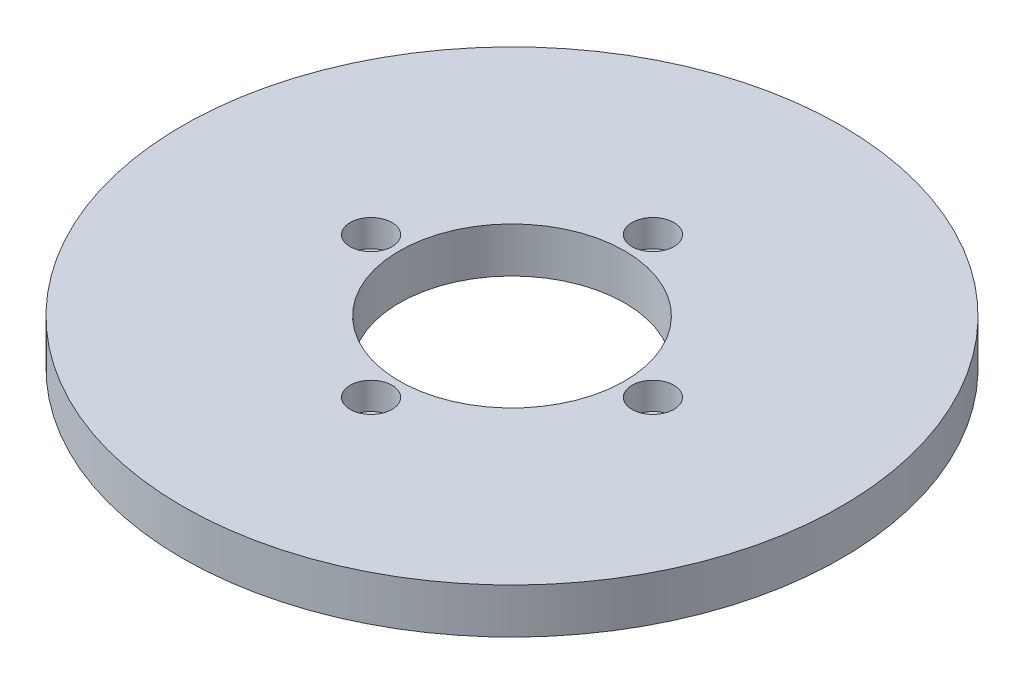
ISO-10303-21;
HEADER;
FILE_DESCRIPTION(('STEP AP214'),'2;1');
FILE_NAME('part.step','',(''),(''),'','','');
FILE_SCHEMA(('AUTOMOTIVE_DESIGN { 1 0 10303 214 1 1 1 1 }'));
ENDSEC;
DATA;
#1=APPLICATION_CONTEXT('core data for automotive mechanical design processes');
#2=APPLICATION_PROTOCOL_DEFINITION('international standard','automotive_design',2000,#1);
#3=PRODUCT_CONTEXT('',#1,'mechanical');
#4=PRODUCT('Part','Part','',(#3));
#5=PRODUCT_RELATED_PRODUCT_CATEGORY('part','',(#4));
#6=PRODUCT_DEFINITION_FORMATION('','',#4);
#7=PRODUCT_DEFINITION_CONTEXT('part definition',#1,'design');
#8=PRODUCT_DEFINITION('design','',#6,#7);
#9=PRODUCT_DEFINITION_SHAPE('','',#8);
#10=(LENGTH_UNIT() NAMED_UNIT(*) SI_UNIT(.MILLI.,.METRE.));
#11=(NAMED_UNIT(*) PLANE_ANGLE_UNIT() SI_UNIT($,.RADIAN.));
#12=(NAMED_UNIT(*) SI_UNIT($,.STERADIAN.) SOLID_ANGLE_UNIT());
#13=UNCERTAINTY_MEASURE_WITH_UNIT(LENGTH_MEASURE(1.E-05),#10,'distance_accuracy_value','');
#14=(GEOMETRIC_REPRESENTATION_CONTEXT(3) GLOBAL_UNCERTAINTY_ASSIGNED_CONTEXT((#13)) GLOBAL_UNIT_ASSIGNED_CONTEXT((#10,
#11,#12)) REPRESENTATION_CONTEXT('',''));
#15=CARTESIAN_POINT('',(0.,0.,0.));
#16=DIRECTION('',(0.,0.,1.));
#17=DIRECTION('',(1.,0.,0.));
#18=AXIS2_PLACEMENT_3D('',#15,#16,#17);
#19=CARTESIAN_POINT('',(0.,13.,0.));
#20=DIRECTION('',(0.,-1.,0.));
#21=DIRECTION('',(0.,0.,-1.));
#22=AXIS2_PLACEMENT_3D('',#19,#20,#21);
#23=CYLINDRICAL_SURFACE('',#22,95.);
#24=CARTESIAN_POINT('',(0.,13.,0.));
#25=DIRECTION('',(0.,1.,0.));
#26=DIRECTION('',(0.,0.,1.));
#27=AXIS2_PLACEMENT_3D('',#24,#25,#26);
#28=CIRCLE('',#27,95.);
#29=CARTESIAN_POINT('',(0.,13.,-95.));
#30=VERTEX_POINT('',#29);
#31=EDGE_CURVE('E10',#30,#30,#28,.T.);
#32=CARTESIAN_POINT('',(0.,0.,0.));
#33=DIRECTION('',(0.,1.,0.));
#34=DIRECTION('',(0.,0.,1.));
#35=AXIS2_PLACEMENT_3D('',#32,#33,#34);
#36=CIRCLE('',#35,95.);
#37=CARTESIAN_POINT('',(0.,0.,-95.));
#38=VERTEX_POINT('',#37);
#39=EDGE_CURVE('E37',#38,#38,#36,.T.);
#40=CARTESIAN_POINT('',(0.,13.,-95.));
#41=CARTESIAN_POINT('',(0.,12.8645833333333,-95.));
#42=CARTESIAN_POINT('',(0.,12.7291666666667,-95.));
#43=CARTESIAN_POINT('',(0.,12.4583333333333,-95.));
#44=CARTESIAN_POINT('',(0.,12.3229166666667,-95.));
#45=CARTESIAN_POINT('',(0.,12.0520833333333,-95.));
#46=CARTESIAN_POINT('',(0.,11.9166666666667,-95.));
#47=CARTESIAN_POINT('',(0.,11.6458333333333,-95.));
#48=CARTESIAN_POINT('',(0.,11.5104166666667,-95.));
#49=CARTESIAN_POINT('',(0.,11.2395833333333,-95.));
#50=CARTESIAN_POINT('',(0.,11.1041666666667,-95.));
#51=CARTESIAN_POINT('',(0.,10.8333333333333,-95.));
#52=CARTESIAN_POINT('',(0.,10.6979166666667,-95.));
#53=CARTESIAN_POINT('',(0.,10.4270833333333,-95.));
#54=CARTESIAN_POINT('',(0.,10.2916666666667,-95.));
#55=CARTESIAN_POINT('',(0.,10.0208333333333,-95.));
#56=CARTESIAN_POINT('',(0.,9.88541666666667,-95.));
#57=CARTESIAN_POINT('',(0.,9.61458333333333,-95.));
#58=CARTESIAN_POINT('',(0.,9.47916666666667,-95.));
#59=CARTESIAN_POINT('',(0.,9.20833333333333,-95.));
#60=CARTESIAN_POINT('',(0.,9.07291666666667,-95.));
#61=CARTESIAN_POINT('',(0.,8.80208333333333,-95.));
#62=CARTESIAN_POINT('',(0.,8.66666666666667,-95.));
#63=CARTESIAN_POINT('',(0.,8.39583333333333,-95.));
#64=CARTESIAN_POINT('',(0.,8.26041666666667,-95.));
#65=CARTESIAN_POINT('',(0.,7.98958333333333,-95.));
#66=CARTESIAN_POINT('',(0.,7.85416666666667,-95.));
#67=CARTESIAN_POINT('',(0.,7.58333333333333,-95.));
#68=CARTESIAN_POINT('',(0.,7.44791666666667,-95.));
#69=CARTESIAN_POINT('',(0.,7.17708333333333,-95.));
#70=CARTESIAN_POINT('',(0.,7.04166666666667,-95.));
#71=CARTESIAN_POINT('',(0.,6.77083333333333,-95.));
#72=CARTESIAN_POINT('',(0.,6.63541666666667,-95.));
#73=CARTESIAN_POINT('',(0.,6.36458333333333,-95.));
#74=CARTESIAN_POINT('',(0.,6.22916666666667,-95.));
#75=CARTESIAN_POINT('',(0.,5.95833333333333,-95.));
#76=CARTESIAN_POINT('',(0.,5.82291666666667,-95.));
#77=CARTESIAN_POINT('',(0.,5.55208333333333,-95.));
#78=CARTESIAN_POINT('',(0.,5.41666666666667,-95.));
#79=CARTESIAN_POINT('',(0.,5.14583333333333,-95.));
#80=CARTESIAN_POINT('',(0.,5.01041666666667,-95.));
#81=CARTESIAN_POINT('',(0.,4.73958333333333,-95.));
#82=CARTESIAN_POINT('',(0.,4.60416666666667,-95.));
#83=CARTESIAN_POINT('',(0.,4.33333333333333,-95.));
#84=CARTESIAN_POINT('',(0.,4.19791666666667,-95.));
#85=CARTESIAN_POINT('',(0.,3.92708333333333,-95.));
#86=CARTESIAN_POINT('',(0.,3.79166666666667,-95.));
#87=CARTESIAN_POINT('',(0.,3.52083333333333,-95.));
#88=CARTESIAN_POINT('',(0.,3.38541666666667,-95.));
#89=CARTESIAN_POINT('',(0.,3.11458333333333,-95.));
#90=CARTESIAN_POINT('',(0.,2.97916666666667,-95.));
#91=CARTESIAN_POINT('',(0.,2.70833333333333,-95.));
#92=CARTESIAN_POINT('',(0.,2.57291666666667,-95.));
#93=CARTESIAN_POINT('',(0.,2.30208333333333,-95.));
#94=CARTESIAN_POINT('',(0.,2.16666666666667,-95.));
#95=CARTESIAN_POINT('',(0.,1.89583333333333,-95.));
#96=CARTESIAN_POINT('',(0.,1.76041666666667,-95.));
#97=CARTESIAN_POINT('',(0.,1.48958333333333,-95.));
#98=CARTESIAN_POINT('',(0.,1.35416666666667,-95.));
#99=CARTESIAN_POINT('',(0.,1.08333333333333,-95.));
#100=CARTESIAN_POINT('',(0.,0.947916666666667,-95.));
#101=CARTESIAN_POINT('',(0.,0.677083333333334,-95.));
#102=CARTESIAN_POINT('',(0.,0.541666666666667,-95.));
#103=CARTESIAN_POINT('',(0.,0.270833333333334,-95.));
#104=CARTESIAN_POINT('',(0.,0.135416666666667,-95.));
#105=CARTESIAN_POINT('',(0.,0.,-95.));
#106=B_SPLINE_CURVE_WITH_KNOTS('',3,(#40,#41,#42,#43,#44,#45,#46,#47,#48,#49,#50,#51,#52,#53,
#54,#55,#56,#57,#58,#59,#60,#61,#62,#63,#64,#65,#66,#67,#68,#69,#70,#71,#72,#73,#74,#75,#76,#77,
#78,#79,#80,#81,#82,#83,#84,#85,#86,#87,#88,#89,#90,#91,#92,#93,#94,#95,#96,#97,#98,#99,#100,
#101,#102,#103,#104,#105),.UNSPECIFIED.,.F.,.F.,(4,2,2,2,2,2,2,2,2,2,2,2,2,2,2,2,2,2,2,2,2,2,2,
2,2,2,2,2,2,2,2,2,4),(0.,0.406249999999999,0.812499999999999,1.21875,1.625,2.03125,2.4375,
2.84375,3.25,3.65625,4.0625,4.46875,4.875,5.28125,5.6875,6.09375,6.5,6.90625,7.3125,7.71875,
8.125,8.53125,8.9375,9.34375,9.75,10.15625,10.5625,10.96875,11.375,11.78125,12.1875,12.59375,
13.),.UNSPECIFIED.);
#107=EDGE_CURVE('BSEAM40',#30,#38,#106,.T.);
#108=ORIENTED_EDGE('',*,*,#31,.F.);
#109=ORIENTED_EDGE('',*,*,#39,.T.);
#110=ORIENTED_EDGE('',*,*,#107,.T.);
#111=ORIENTED_EDGE('',*,*,#107,.F.);
#112=EDGE_LOOP('',(#108,#110,#109,#111));
#113=FACE_BOUND('',#112,.T.);
#114=ADVANCED_FACE('F40',(#113),#23,.T.);
#115=CARTESIAN_POINT('',(0.,13.,0.));
#116=DIRECTION('',(0.,1.,0.));
#117=DIRECTION('',(0.,0.,1.));
#118=AXIS2_PLACEMENT_3D('',#115,#116,#117);
#119=PLANE('',#118);
#120=CARTESIAN_POINT('',(1.4185215696723E-13,13.,40.6280725000899));
#121=DIRECTION('',(0.,1.,0.));
#122=DIRECTION('',(1.,0.,0.));
#123=AXIS2_PLACEMENT_3D('',#120,#121,#122);
#124=CIRCLE('',#123,6.03825694009984);
#125=CARTESIAN_POINT('',(6.03825694009999,13.,40.6280725000899));
#126=VERTEX_POINT('',#125);
#127=EDGE_CURVE('E71',#126,#126,#124,.T.);
#128=ORIENTED_EDGE('',*,*,#127,.F.);
#129=EDGE_LOOP('',(#128));
#130=FACE_BOUND('',#129,.T.);
#131=CARTESIAN_POINT('',(40.6280725000899,13.,0.));
#132=DIRECTION('',(0.,1.,0.));
#133=DIRECTION('',(0.,0.,-1.));
#134=AXIS2_PLACEMENT_3D('',#131,#132,#133);
#135=CIRCLE('',#134,6.03825694009984);
#136=CARTESIAN_POINT('',(40.6280725000899,13.,-6.03825694009984));
#137=VERTEX_POINT('',#136);
#138=EDGE_CURVE('E70',#137,#137,#135,.T.);
#139=ORIENTED_EDGE('',*,*,#138,.F.);
#140=EDGE_LOOP('',(#139));
#141=FACE_BOUND('',#140,.T.);
#142=CARTESIAN_POINT('',(-4.25556470901689E-13,13.,-40.6280725000899));
#143=DIRECTION('',(0.,1.,0.));
#144=DIRECTION('',(-1.,0.,0.));
#145=AXIS2_PLACEMENT_3D('',#142,#143,#144);
#146=CIRCLE('',#145,6.03825694009984);
#147=CARTESIAN_POINT('',(-6.03825694010027,13.,-40.6280725000898));
#148=VERTEX_POINT('',#147);
#149=EDGE_CURVE('E61',#148,#148,#146,.T.);
#150=ORIENTED_EDGE('',*,*,#149,.F.);
#151=EDGE_LOOP('',(#150));
#152=FACE_BOUND('',#151,.T.);
#153=CARTESIAN_POINT('',(-40.6280725000899,13.,0.));
#154=DIRECTION('',(0.,1.,0.));
#155=DIRECTION('',(0.,0.,1.));
#156=AXIS2_PLACEMENT_3D('',#153,#154,#155);
#157=CIRCLE('',#156,6.03825694009984);
#158=CARTESIAN_POINT('',(-40.6280725000899,13.,6.03825694009984));
#159=VERTEX_POINT('',#158);
#160=EDGE_CURVE('E54',#159,#159,#157,.T.);
#161=ORIENTED_EDGE('',*,*,#160,.F.);
#162=EDGE_LOOP('',(#161));
#163=FACE_BOUND('',#162,.T.);
#164=CARTESIAN_POINT('',(0.,13.,0.));
#165=DIRECTION('',(0.,1.,0.));
#166=DIRECTION('',(0.,0.,1.));
#167=AXIS2_PLACEMENT_3D('',#164,#165,#166);
#168=CIRCLE('',#167,32.5);
#169=CARTESIAN_POINT('',(0.,13.,-32.5));
#170=VERTEX_POINT('',#169);
#171=EDGE_CURVE('E50',#170,#170,#168,.T.);
#172=ORIENTED_EDGE('',*,*,#171,.F.);
#173=EDGE_LOOP('',(#172));
#174=FACE_BOUND('',#173,.T.);
#175=ORIENTED_EDGE('',*,*,#31,.T.);
#176=EDGE_LOOP('',(#175));
#177=FACE_BOUND('',#176,.T.);
#178=ADVANCED_FACE('F86',(#130,#141,#152,#163,#174,#177),#119,.T.);
#179=CARTESIAN_POINT('',(0.,0.,0.));
#180=DIRECTION('',(0.,1.,0.));
#181=DIRECTION('',(0.,0.,1.));
#182=AXIS2_PLACEMENT_3D('',#179,#180,#181);
#183=PLANE('',#182);
#184=CARTESIAN_POINT('',(0.,0.,0.));
#185=DIRECTION('',(0.,1.,0.));
#186=DIRECTION('',(0.,0.,1.));
#187=AXIS2_PLACEMENT_3D('',#184,#185,#186);
#188=CIRCLE('',#187,32.5);
#189=CARTESIAN_POINT('',(0.,0.,-32.5));
#190=VERTEX_POINT('',#189);
#191=EDGE_CURVE('E47',#190,#190,#188,.T.);
#192=ORIENTED_EDGE('',*,*,#191,.T.);
#193=EDGE_LOOP('',(#192));
#194=FACE_BOUND('',#193,.T.);
#195=ORIENTED_EDGE('',*,*,#39,.F.);
#196=EDGE_LOOP('',(#195));
#197=FACE_BOUND('',#196,.T.);
#198=ADVANCED_FACE('F93',(#194,#197),#183,.F.);
#199=CARTESIAN_POINT('',(0.,13.,0.));
#200=DIRECTION('',(0.,-1.,0.));
#201=DIRECTION('',(0.,0.,-1.));
#202=AXIS2_PLACEMENT_3D('',#199,#200,#201);
#203=CYLINDRICAL_SURFACE('',#202,32.5);
#204=CARTESIAN_POINT('',(0.,13.,-32.5));
#205=CARTESIAN_POINT('',(0.,12.8645833333333,-32.5));
#206=CARTESIAN_POINT('',(0.,12.7291666666667,-32.5));
#207=CARTESIAN_POINT('',(0.,12.4583333333333,-32.5));
#208=CARTESIAN_POINT('',(0.,12.3229166666667,-32.5));
#209=CARTESIAN_POINT('',(0.,12.0520833333333,-32.5));
#210=CARTESIAN_POINT('',(0.,11.9166666666667,-32.5));
#211=CARTESIAN_POINT('',(0.,11.6458333333333,-32.5));
#212=CARTESIAN_POINT('',(0.,11.5104166666667,-32.5));
#213=CARTESIAN_POINT('',(0.,11.2395833333333,-32.5));
#214=CARTESIAN_POINT('',(0.,11.1041666666667,-32.5));
#215=CARTESIAN_POINT('',(0.,10.8333333333333,-32.5));
#216=CARTESIAN_POINT('',(0.,10.6979166666667,-32.5));
#217=CARTESIAN_POINT('',(0.,10.4270833333333,-32.5));
#218=CARTESIAN_POINT('',(0.,10.2916666666667,-32.5));
#219=CARTESIAN_POINT('',(0.,10.0208333333333,-32.5));
#220=CARTESIAN_POINT('',(0.,9.88541666666667,-32.5));
#221=CARTESIAN_POINT('',(0.,9.61458333333333,-32.5));
#222=CARTESIAN_POINT('',(0.,9.47916666666667,-32.5));
#223=CARTESIAN_POINT('',(0.,9.20833333333333,-32.5));
#224=CARTESIAN_POINT('',(0.,9.07291666666667,-32.5));
#225=CARTESIAN_POINT('',(0.,8.80208333333333,-32.5));
#226=CARTESIAN_POINT('',(0.,8.66666666666667,-32.5));
#227=CARTESIAN_POINT('',(0.,8.39583333333333,-32.5));
#228=CARTESIAN_POINT('',(0.,8.26041666666667,-32.5));
#229=CARTESIAN_POINT('',(0.,7.98958333333333,-32.5));
#230=CARTESIAN_POINT('',(0.,7.85416666666667,-32.5));
#231=CARTESIAN_POINT('',(0.,7.58333333333333,-32.5));
#232=CARTESIAN_POINT('',(0.,7.44791666666667,-32.5));
#233=CARTESIAN_POINT('',(0.,7.17708333333333,-32.5));
#234=CARTESIAN_POINT('',(0.,7.04166666666667,-32.5));
#235=CARTESIAN_POINT('',(0.,6.77083333333333,-32.5));
#236=CARTESIAN_POINT('',(0.,6.63541666666667,-32.5));
#237=CARTESIAN_POINT('',(0.,6.36458333333333,-32.5));
#238=CARTESIAN_POINT('',(0.,6.22916666666667,-32.5));
#239=CARTESIAN_POINT('',(0.,5.95833333333333,-32.5));
#240=CARTESIAN_POINT('',(0.,5.82291666666667,-32.5));
#241=CARTESIAN_POINT('',(0.,5.55208333333333,-32.5));
#242=CARTESIAN_POINT('',(0.,5.41666666666667,-32.5));
#243=CARTESIAN_POINT('',(0.,5.14583333333333,-32.5));
#244=CARTESIAN_POINT('',(0.,5.01041666666667,-32.5));
#245=CARTESIAN_POINT('',(0.,4.73958333333333,-32.5));
#246=CARTESIAN_POINT('',(0.,4.60416666666667,-32.5));
#247=CARTESIAN_POINT('',(0.,4.33333333333333,-32.5));
#248=CARTESIAN_POINT('',(0.,4.19791666666667,-32.5));
#249=CARTESIAN_POINT('',(0.,3.92708333333333,-32.5));
#250=CARTESIAN_POINT('',(0.,3.79166666666667,-32.5));
#251=CARTESIAN_POINT('',(0.,3.52083333333333,-32.5));
#252=CARTESIAN_POINT('',(0.,3.38541666666667,-32.5));
#253=CARTESIAN_POINT('',(0.,3.11458333333333,-32.5));
#254=CARTESIAN_POINT('',(0.,2.97916666666667,-32.5));
#255=CARTESIAN_POINT('',(0.,2.70833333333333,-32.5));
#256=CARTESIAN_POINT('',(0.,2.57291666666667,-32.5));
#257=CARTESIAN_POINT('',(0.,2.30208333333333,-32.5));
#258=CARTESIAN_POINT('',(0.,2.16666666666667,-32.5));
#259=CARTESIAN_POINT('',(0.,1.89583333333333,-32.5));
#260=CARTESIAN_POINT('',(0.,1.76041666666667,-32.5));
#261=CARTESIAN_POINT('',(0.,1.48958333333333,-32.5));
#262=CARTESIAN_POINT('',(0.,1.35416666666667,-32.5));
#263=CARTESIAN_POINT('',(0.,1.08333333333333,-32.5));
#264=CARTESIAN_POINT('',(0.,0.947916666666667,-32.5));
#265=CARTESIAN_POINT('',(0.,0.677083333333334,-32.5));
#266=CARTESIAN_POINT('',(0.,0.541666666666667,-32.5));
#267=CARTESIAN_POINT('',(0.,0.270833333333334,-32.5));
#268=CARTESIAN_POINT('',(0.,0.135416666666667,-32.5));
#269=CARTESIAN_POINT('',(0.,0.,-32.5));
#270=B_SPLINE_CURVE_WITH_KNOTS('',3,(#204,#205,#206,#207,#208,#209,#210,#211,#212,#213,#214,
#215,#216,#217,#218,#219,#220,#221,#222,#223,#224,#225,#226,#227,#228,#229,#230,#231,#232,#233,
#234,#235,#236,#237,#238,#239,#240,#241,#242,#243,#244,#245,#246,#247,#248,#249,#250,#251,#252,
#253,#254,#255,#256,#257,#258,#259,#260,#261,#262,#263,#264,#265,#266,#267,#268,#269),
.UNSPECIFIED.,.F.,.F.,(4,2,2,2,2,2,2,2,2,2,2,2,2,2,2,2,2,2,2,2,2,2,2,2,2,2,2,2,2,2,2,2,4),(0.,
0.406249999999999,0.812499999999999,1.21875,1.625,2.03125,2.4375,2.84375,3.25,3.65625,4.0625,
4.46875,4.875,5.28125,5.6875,6.09375,6.5,6.90625,7.3125,7.71875,8.125,8.53125,8.9375,9.34375,
9.75,10.15625,10.5625,10.96875,11.375,11.78125,12.1875,12.59375,13.),.UNSPECIFIED.);
#271=EDGE_CURVE('BSEAM101',#170,#190,#270,.T.);
#272=ORIENTED_EDGE('',*,*,#171,.T.);
#273=ORIENTED_EDGE('',*,*,#191,.F.);
#274=ORIENTED_EDGE('',*,*,#271,.T.);
#275=ORIENTED_EDGE('',*,*,#271,.F.);
#276=EDGE_LOOP('',(#272,#274,#273,#275));
#277=FACE_BOUND('',#276,.T.);
#278=ADVANCED_FACE('F101',(#277),#203,.F.);
#279=CARTESIAN_POINT('',(-40.6280725000899,5.18492960182039,0.));
#280=DIRECTION('',(0.,1.,0.));
#281=DIRECTION('',(0.,0.,1.));
#282=AXIS2_PLACEMENT_3D('',#279,#280,#281);
#283=CYLINDRICAL_SURFACE('',#282,6.03825694009984);
#284=CARTESIAN_POINT('',(-40.6280725000899,5.18492960182039,0.));
#285=DIRECTION('',(0.,1.,0.));
#286=DIRECTION('',(0.,0.,1.));
#287=AXIS2_PLACEMENT_3D('',#284,#285,#286);
#288=CIRCLE('',#287,6.03825694009984);
#289=CARTESIAN_POINT('',(-40.6280725000899,5.18492960182039,6.03825694009984));
#290=VERTEX_POINT('',#289);
#291=EDGE_CURVE('E55',#290,#290,#288,.T.);
#292=ORIENTED_EDGE('',*,*,#291,.F.);
#293=EDGE_LOOP('',(#292));
#294=FACE_BOUND('',#293,.T.);
#295=ORIENTED_EDGE('',*,*,#160,.T.);
#296=EDGE_LOOP('',(#295));
#297=FACE_BOUND('',#296,.T.);
#298=ADVANCED_FACE('F102',(#294,#297),#283,.F.);
#299=CARTESIAN_POINT('',(-40.6280725000899,5.18492960182039,0.));
#300=DIRECTION('',(0.,1.,0.));
#301=DIRECTION('',(0.,0.,1.));
#302=AXIS2_PLACEMENT_3D('',#299,#300,#301);
#303=PLANE('',#302);
#304=ORIENTED_EDGE('',*,*,#291,.T.);
#305=EDGE_LOOP('',(#304));
#306=FACE_BOUND('',#305,.T.);
#307=ADVANCED_FACE('F133',(#306),#303,.T.);
#308=CARTESIAN_POINT('',(-4.25556470901689E-13,5.18492960182039,-40.6280725000899));
#309=DIRECTION('',(0.,1.,0.));
#310=DIRECTION('',(0.,0.,1.));
#311=AXIS2_PLACEMENT_3D('',#308,#309,#310);
#312=CYLINDRICAL_SURFACE('',#311,6.03825694009984);
#313=CARTESIAN_POINT('',(-4.25556470901689E-13,5.18492960182039,-40.6280725000899));
#314=DIRECTION('',(0.,1.,0.));
#315=DIRECTION('',(-1.,0.,0.));
#316=AXIS2_PLACEMENT_3D('',#313,#314,#315);
#317=CIRCLE('',#316,6.03825694009984);
#318=CARTESIAN_POINT('',(-6.03825694010027,5.18492960182039,-40.6280725000898));
#319=VERTEX_POINT('',#318);
#320=EDGE_CURVE('E63',#319,#319,#317,.T.);
#321=ORIENTED_EDGE('',*,*,#320,.F.);
#322=EDGE_LOOP('',(#321));
#323=FACE_BOUND('',#322,.T.);
#324=ORIENTED_EDGE('',*,*,#149,.T.);
#325=EDGE_LOOP('',(#324));
#326=FACE_BOUND('',#325,.T.);
#327=ADVANCED_FACE('F142',(#323,#326),#312,.F.);
#328=CARTESIAN_POINT('',(-4.25556470901689E-13,5.18492960182039,-40.6280725000899));
#329=DIRECTION('',(0.,1.,0.));
#330=DIRECTION('',(-1.,0.,0.));
#331=AXIS2_PLACEMENT_3D('',#328,#329,#330);
#332=PLANE('',#331);
#333=ORIENTED_EDGE('',*,*,#320,.T.);
#334=EDGE_LOOP('',(#333));
#335=FACE_BOUND('',#334,.T.);
#336=ADVANCED_FACE('F156',(#335),#332,.T.);
#337=CARTESIAN_POINT('',(40.6280725000899,5.18492960182039,0.));
#338=DIRECTION('',(0.,1.,0.));
#339=DIRECTION('',(0.,0.,1.));
#340=AXIS2_PLACEMENT_3D('',#337,#338,#339);
#341=CYLINDRICAL_SURFACE('',#340,6.03825694009984);
#342=CARTESIAN_POINT('',(40.6280725000899,5.18492960182039,0.));
#343=DIRECTION('',(0.,1.,0.));
#344=DIRECTION('',(0.,0.,-1.));
#345=AXIS2_PLACEMENT_3D('',#342,#343,#344);
#346=CIRCLE('',#345,6.03825694009984);
#347=CARTESIAN_POINT('',(40.6280725000899,5.18492960182039,-6.03825694009984));
#348=VERTEX_POINT('',#347);
#349=EDGE_CURVE('E69',#348,#348,#346,.T.);
#350=ORIENTED_EDGE('',*,*,#349,.F.);
#351=EDGE_LOOP('',(#350));
#352=FACE_BOUND('',#351,.T.);
#353=ORIENTED_EDGE('',*,*,#138,.T.);
#354=EDGE_LOOP('',(#353));
#355=FACE_BOUND('',#354,.T.);
#356=ADVANCED_FACE('F164',(#352,#355),#341,.F.);
#357=CARTESIAN_POINT('',(40.6280725000899,5.18492960182039,0.));
#358=DIRECTION('',(0.,1.,0.));
#359=DIRECTION('',(0.,0.,-1.));
#360=AXIS2_PLACEMENT_3D('',#357,#358,#359);
#361=PLANE('',#360);
#362=ORIENTED_EDGE('',*,*,#349,.T.);
#363=EDGE_LOOP('',(#362));
#364=FACE_BOUND('',#363,.T.);
#365=ADVANCED_FACE('F83',(#364),#361,.T.);
#366=CARTESIAN_POINT('',(1.4185215696723E-13,5.18492960182039,40.6280725000899));
#367=DIRECTION('',(0.,1.,0.));
#368=DIRECTION('',(0.,0.,1.));
#369=AXIS2_PLACEMENT_3D('',#366,#367,#368);
#370=CYLINDRICAL_SURFACE('',#369,6.03825694009984);
#371=CARTESIAN_POINT('',(1.4185215696723E-13,5.18492960182039,40.6280725000899));
#372=DIRECTION('',(0.,1.,0.));
#373=DIRECTION('',(1.,0.,0.));
#374=AXIS2_PLACEMENT_3D('',#371,#372,#373);
#375=CIRCLE('',#374,6.03825694009984);
#376=CARTESIAN_POINT('',(6.03825694009999,5.18492960182039,40.6280725000899));
#377=VERTEX_POINT('',#376);
#378=EDGE_CURVE('E59',#377,#377,#375,.T.);
#379=ORIENTED_EDGE('',*,*,#378,.F.);
#380=EDGE_LOOP('',(#379));
#381=FACE_BOUND('',#380,.T.);
#382=ORIENTED_EDGE('',*,*,#127,.T.);
#383=EDGE_LOOP('',(#382));
#384=FACE_BOUND('',#383,.T.);
#385=ADVANCED_FACE('F81',(#381,#384),#370,.F.);
#386=CARTESIAN_POINT('',(1.4185215696723E-13,5.18492960182039,40.6280725000899));
#387=DIRECTION('',(0.,1.,0.));
#388=DIRECTION('',(1.,0.,0.));
#389=AXIS2_PLACEMENT_3D('',#386,#387,#388);
#390=PLANE('',#389);
#391=ORIENTED_EDGE('',*,*,#378,.T.);
#392=EDGE_LOOP('',(#391));
#393=FACE_BOUND('',#392,.T.);
#394=ADVANCED_FACE('F78',(#393),#390,.T.);
#395=CLOSED_SHELL('',(#114,#178,#198,#278,#298,#307,#327,#336,#356,#365,#385,#394));
#396=MANIFOLD_SOLID_BREP('B2',#395);
#397=ADVANCED_BREP_SHAPE_REPRESENTATION('',(#18,#396),#14);
#398=SHAPE_DEFINITION_REPRESENTATION(#9,#397);
ENDSEC;
END-ISO-10303-21;
